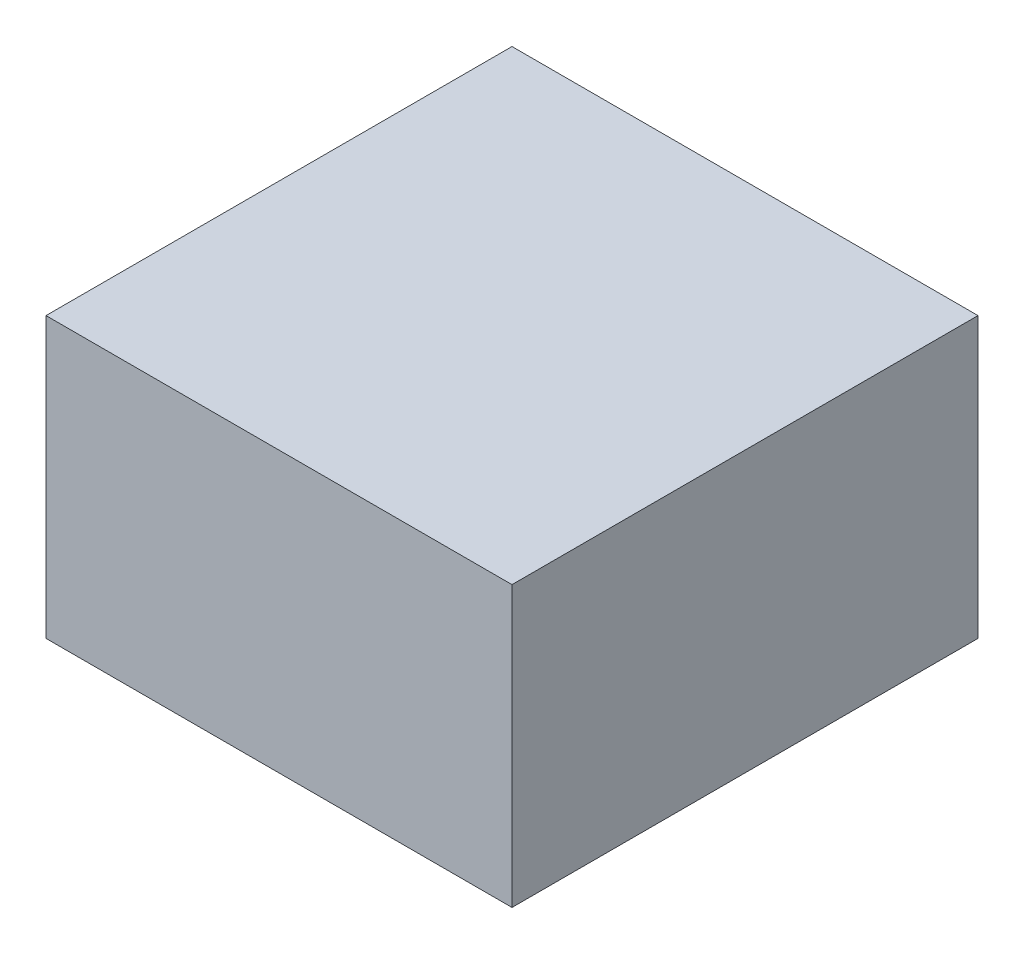
ISO-10303-21;
HEADER;
FILE_DESCRIPTION(('STEP AP214'),'2;1');
FILE_NAME('part.step','',(''),(''),'','','');
FILE_SCHEMA(('AUTOMOTIVE_DESIGN { 1 0 10303 214 1 1 1 1 }'));
ENDSEC;
DATA;
#1=APPLICATION_CONTEXT('core data for automotive mechanical design processes');
#2=APPLICATION_PROTOCOL_DEFINITION('international standard','automotive_design',2000,#1);
#3=PRODUCT_CONTEXT('',#1,'mechanical');
#4=PRODUCT('Part','Part','',(#3));
#5=PRODUCT_RELATED_PRODUCT_CATEGORY('part','',(#4));
#6=PRODUCT_DEFINITION_FORMATION('','',#4);
#7=PRODUCT_DEFINITION_CONTEXT('part definition',#1,'design');
#8=PRODUCT_DEFINITION('design','',#6,#7);
#9=PRODUCT_DEFINITION_SHAPE('','',#8);
#10=(LENGTH_UNIT() NAMED_UNIT(*) SI_UNIT(.MILLI.,.METRE.));
#11=(NAMED_UNIT(*) PLANE_ANGLE_UNIT() SI_UNIT($,.RADIAN.));
#12=(NAMED_UNIT(*) SI_UNIT($,.STERADIAN.) SOLID_ANGLE_UNIT());
#13=UNCERTAINTY_MEASURE_WITH_UNIT(LENGTH_MEASURE(1.E-05),#10,'distance_accuracy_value','');
#14=(GEOMETRIC_REPRESENTATION_CONTEXT(3) GLOBAL_UNCERTAINTY_ASSIGNED_CONTEXT((#13)) GLOBAL_UNIT_ASSIGNED_CONTEXT((#10,
#11,#12)) REPRESENTATION_CONTEXT('',''));
#15=CARTESIAN_POINT('',(0.,0.,0.));
#16=DIRECTION('',(0.,0.,1.));
#17=DIRECTION('',(1.,0.,0.));
#18=AXIS2_PLACEMENT_3D('',#15,#16,#17);
#19=CARTESIAN_POINT('',(31.75,38.1,-31.75));
#20=DIRECTION('',(-1.,0.,0.));
#21=DIRECTION('',(0.,0.,1.));
#22=AXIS2_PLACEMENT_3D('',#19,#20,#21);
#23=PLANE('',#22);
#24=DIRECTION('',(0.,0.,-1.));
#25=VECTOR('',#24,1.);
#26=CARTESIAN_POINT('',(31.75,0.,-31.75));
#27=LINE('',#26,#25);
#28=CARTESIAN_POINT('',(31.75,0.,31.75));
#29=VERTEX_POINT('',#28);
#30=CARTESIAN_POINT('',(31.75,0.,-31.75));
#31=VERTEX_POINT('',#30);
#32=EDGE_CURVE('E98',#29,#31,#27,.T.);
#33=ORIENTED_EDGE('',*,*,#32,.T.);
#34=DIRECTION('',(0.,-1.,0.));
#35=VECTOR('',#34,1.);
#36=CARTESIAN_POINT('',(31.75,38.1,-31.75));
#37=LINE('',#36,#35);
#38=CARTESIAN_POINT('',(31.75,38.1,-31.75));
#39=VERTEX_POINT('',#38);
#40=EDGE_CURVE('E11',#39,#31,#37,.T.);
#41=ORIENTED_EDGE('',*,*,#40,.F.);
#42=DIRECTION('',(0.,0.,-1.));
#43=VECTOR('',#42,1.);
#44=CARTESIAN_POINT('',(31.75,38.1,-31.75));
#45=LINE('',#44,#43);
#46=CARTESIAN_POINT('',(31.75,38.1,31.75));
#47=VERTEX_POINT('',#46);
#48=EDGE_CURVE('E86',#47,#39,#45,.T.);
#49=ORIENTED_EDGE('',*,*,#48,.F.);
#50=DIRECTION('',(0.,-1.,0.));
#51=VECTOR('',#50,1.);
#52=CARTESIAN_POINT('',(31.75,38.1,31.75));
#53=LINE('',#52,#51);
#54=EDGE_CURVE('E94',#47,#29,#53,.T.);
#55=ORIENTED_EDGE('',*,*,#54,.T.);
#56=EDGE_LOOP('',(#33,#41,#49,#55));
#57=FACE_BOUND('',#56,.T.);
#58=ADVANCED_FACE('F35',(#57),#23,.F.);
#59=CARTESIAN_POINT('',(-31.75,38.1,-31.75));
#60=DIRECTION('',(0.,0.,1.));
#61=DIRECTION('',(1.,0.,0.));
#62=AXIS2_PLACEMENT_3D('',#59,#60,#61);
#63=PLANE('',#62);
#64=DIRECTION('',(-1.,0.,0.));
#65=VECTOR('',#64,1.);
#66=CARTESIAN_POINT('',(-31.75,0.,-31.75));
#67=LINE('',#66,#65);
#68=CARTESIAN_POINT('',(-31.75,0.,-31.75));
#69=VERTEX_POINT('',#68);
#70=EDGE_CURVE('E90',#31,#69,#67,.T.);
#71=ORIENTED_EDGE('',*,*,#70,.T.);
#72=DIRECTION('',(0.,-1.,0.));
#73=VECTOR('',#72,1.);
#74=CARTESIAN_POINT('',(-31.75,38.1,-31.75));
#75=LINE('',#74,#73);
#76=CARTESIAN_POINT('',(-31.75,38.1,-31.75));
#77=VERTEX_POINT('',#76);
#78=EDGE_CURVE('E43',#77,#69,#75,.T.);
#79=ORIENTED_EDGE('',*,*,#78,.F.);
#80=DIRECTION('',(-1.,0.,0.));
#81=VECTOR('',#80,1.);
#82=CARTESIAN_POINT('',(-31.75,38.1,-31.75));
#83=LINE('',#82,#81);
#84=EDGE_CURVE('E81',#39,#77,#83,.T.);
#85=ORIENTED_EDGE('',*,*,#84,.F.);
#86=ORIENTED_EDGE('',*,*,#40,.T.);
#87=EDGE_LOOP('',(#71,#79,#85,#86));
#88=FACE_BOUND('',#87,.T.);
#89=ADVANCED_FACE('F89',(#88),#63,.F.);
#90=CARTESIAN_POINT('',(-31.75,38.1,-31.75));
#91=DIRECTION('',(1.,0.,0.));
#92=DIRECTION('',(0.,0.,-1.));
#93=AXIS2_PLACEMENT_3D('',#90,#91,#92);
#94=PLANE('',#93);
#95=DIRECTION('',(0.,0.,1.));
#96=VECTOR('',#95,1.);
#97=CARTESIAN_POINT('',(-31.75,0.,-31.75));
#98=LINE('',#97,#96);
#99=CARTESIAN_POINT('',(-31.75,0.,31.75));
#100=VERTEX_POINT('',#99);
#101=EDGE_CURVE('E68',#69,#100,#98,.T.);
#102=ORIENTED_EDGE('',*,*,#101,.T.);
#103=DIRECTION('',(0.,-1.,0.));
#104=VECTOR('',#103,1.);
#105=CARTESIAN_POINT('',(-31.75,38.1,31.75));
#106=LINE('',#105,#104);
#107=CARTESIAN_POINT('',(-31.75,38.1,31.75));
#108=VERTEX_POINT('',#107);
#109=EDGE_CURVE('E91',#108,#100,#106,.T.);
#110=ORIENTED_EDGE('',*,*,#109,.F.);
#111=DIRECTION('',(0.,0.,1.));
#112=VECTOR('',#111,1.);
#113=CARTESIAN_POINT('',(-31.75,38.1,-31.75));
#114=LINE('',#113,#112);
#115=EDGE_CURVE('E84',#77,#108,#114,.T.);
#116=ORIENTED_EDGE('',*,*,#115,.F.);
#117=ORIENTED_EDGE('',*,*,#78,.T.);
#118=EDGE_LOOP('',(#102,#110,#116,#117));
#119=FACE_BOUND('',#118,.T.);
#120=ADVANCED_FACE('F92',(#119),#94,.F.);
#121=CARTESIAN_POINT('',(-31.75,38.1,31.75));
#122=DIRECTION('',(0.,0.,-1.));
#123=DIRECTION('',(-1.,0.,0.));
#124=AXIS2_PLACEMENT_3D('',#121,#122,#123);
#125=PLANE('',#124);
#126=DIRECTION('',(1.,0.,0.));
#127=VECTOR('',#126,1.);
#128=CARTESIAN_POINT('',(-31.75,0.,31.75));
#129=LINE('',#128,#127);
#130=EDGE_CURVE('E74',#100,#29,#129,.T.);
#131=ORIENTED_EDGE('',*,*,#130,.T.);
#132=ORIENTED_EDGE('',*,*,#54,.F.);
#133=DIRECTION('',(1.,0.,0.));
#134=VECTOR('',#133,1.);
#135=CARTESIAN_POINT('',(-31.75,38.1,31.75));
#136=LINE('',#135,#134);
#137=EDGE_CURVE('E51',#108,#47,#136,.T.);
#138=ORIENTED_EDGE('',*,*,#137,.F.);
#139=ORIENTED_EDGE('',*,*,#109,.T.);
#140=EDGE_LOOP('',(#131,#132,#138,#139));
#141=FACE_BOUND('',#140,.T.);
#142=ADVANCED_FACE('F105',(#141),#125,.F.);
#143=CARTESIAN_POINT('',(0.,38.1,0.));
#144=DIRECTION('',(0.,1.,0.));
#145=DIRECTION('',(0.,0.,1.));
#146=AXIS2_PLACEMENT_3D('',#143,#144,#145);
#147=PLANE('',#146);
#148=ORIENTED_EDGE('',*,*,#48,.T.);
#149=ORIENTED_EDGE('',*,*,#84,.T.);
#150=ORIENTED_EDGE('',*,*,#115,.T.);
#151=ORIENTED_EDGE('',*,*,#137,.T.);
#152=EDGE_LOOP('',(#148,#149,#150,#151));
#153=FACE_BOUND('',#152,.T.);
#154=ADVANCED_FACE('F82',(#153),#147,.T.);
#155=CARTESIAN_POINT('',(0.,0.,0.));
#156=DIRECTION('',(0.,1.,0.));
#157=DIRECTION('',(0.,0.,1.));
#158=AXIS2_PLACEMENT_3D('',#155,#156,#157);
#159=PLANE('',#158);
#160=ORIENTED_EDGE('',*,*,#32,.F.);
#161=ORIENTED_EDGE('',*,*,#130,.F.);
#162=ORIENTED_EDGE('',*,*,#101,.F.);
#163=ORIENTED_EDGE('',*,*,#70,.F.);
#164=EDGE_LOOP('',(#160,#161,#162,#163));
#165=FACE_BOUND('',#164,.T.);
#166=ADVANCED_FACE('F108',(#165),#159,.F.);
#167=CLOSED_SHELL('',(#58,#89,#120,#142,#154,#166));
#168=MANIFOLD_SOLID_BREP('B2',#167);
#169=ADVANCED_BREP_SHAPE_REPRESENTATION('',(#18,#168),#14);
#170=SHAPE_DEFINITION_REPRESENTATION(#9,#169);
ENDSEC;
END-ISO-10303-21;
